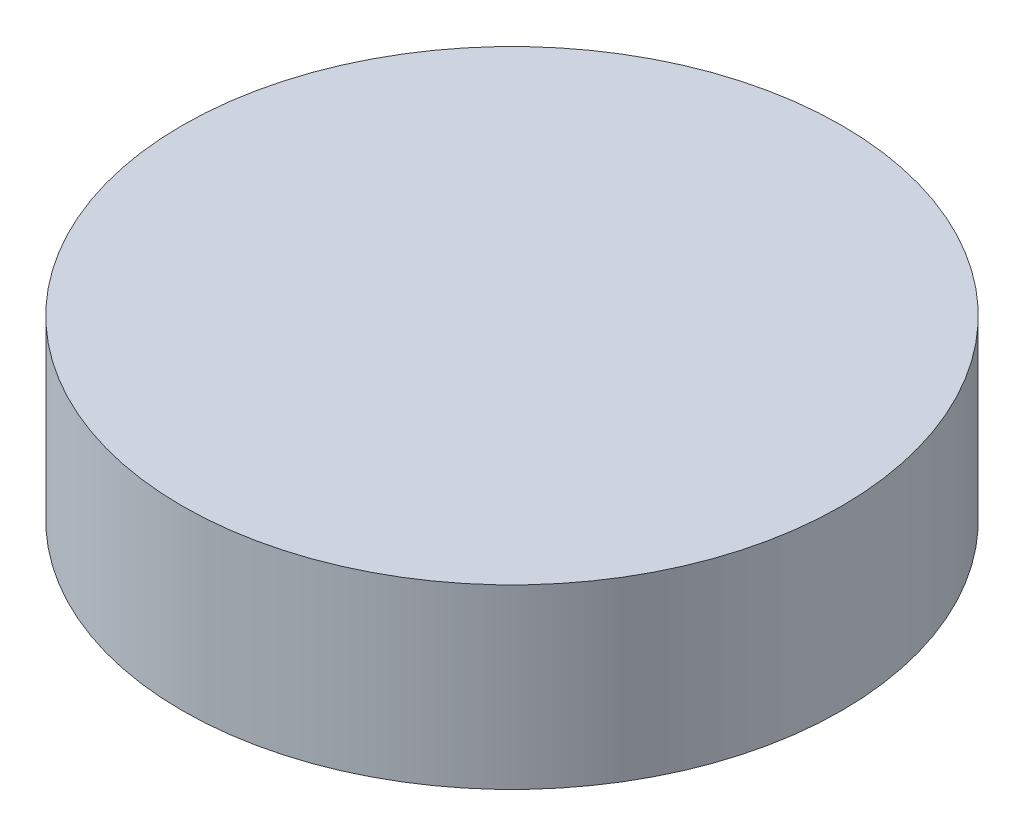
ISO-10303-21;
HEADER;
FILE_DESCRIPTION(('STEP AP214'),'2;1');
FILE_NAME('part.step','',(''),(''),'','','');
FILE_SCHEMA(('AUTOMOTIVE_DESIGN { 1 0 10303 214 1 1 1 1 }'));
ENDSEC;
DATA;
#1=APPLICATION_CONTEXT('core data for automotive mechanical design processes');
#2=APPLICATION_PROTOCOL_DEFINITION('international standard','automotive_design',2000,#1);
#3=PRODUCT_CONTEXT('',#1,'mechanical');
#4=PRODUCT('Part','Part','',(#3));
#5=PRODUCT_RELATED_PRODUCT_CATEGORY('part','',(#4));
#6=PRODUCT_DEFINITION_FORMATION('','',#4);
#7=PRODUCT_DEFINITION_CONTEXT('part definition',#1,'design');
#8=PRODUCT_DEFINITION('design','',#6,#7);
#9=PRODUCT_DEFINITION_SHAPE('','',#8);
#10=(LENGTH_UNIT() NAMED_UNIT(*) SI_UNIT(.MILLI.,.METRE.));
#11=(NAMED_UNIT(*) PLANE_ANGLE_UNIT() SI_UNIT($,.RADIAN.));
#12=(NAMED_UNIT(*) SI_UNIT($,.STERADIAN.) SOLID_ANGLE_UNIT());
#13=UNCERTAINTY_MEASURE_WITH_UNIT(LENGTH_MEASURE(1.E-05),#10,'distance_accuracy_value','');
#14=(GEOMETRIC_REPRESENTATION_CONTEXT(3) GLOBAL_UNCERTAINTY_ASSIGNED_CONTEXT((#13)) GLOBAL_UNIT_ASSIGNED_CONTEXT((#10,
#11,#12)) REPRESENTATION_CONTEXT('',''));
#15=CARTESIAN_POINT('',(0.,0.,0.));
#16=DIRECTION('',(0.,0.,1.));
#17=DIRECTION('',(1.,0.,0.));
#18=AXIS2_PLACEMENT_3D('',#15,#16,#17);
#19=CARTESIAN_POINT('',(0.,11.5,0.));
#20=DIRECTION('',(0.,-1.,0.));
#21=DIRECTION('',(0.,0.,-1.));
#22=AXIS2_PLACEMENT_3D('',#19,#20,#21);
#23=CYLINDRICAL_SURFACE('',#22,21.4);
#24=CARTESIAN_POINT('',(0.,11.5,0.));
#25=DIRECTION('',(0.,1.,0.));
#26=DIRECTION('',(0.,0.,1.));
#27=AXIS2_PLACEMENT_3D('',#24,#25,#26);
#28=CIRCLE('',#27,21.4);
#29=CARTESIAN_POINT('',(0.,11.5,21.4));
#30=VERTEX_POINT('',#29);
#31=EDGE_CURVE('E10',#30,#30,#28,.T.);
#32=ORIENTED_EDGE('',*,*,#31,.F.);
#33=EDGE_LOOP('',(#32));
#34=FACE_BOUND('',#33,.T.);
#35=CARTESIAN_POINT('',(0.,0.,0.));
#36=DIRECTION('',(0.,1.,0.));
#37=DIRECTION('',(0.,0.,1.));
#38=AXIS2_PLACEMENT_3D('',#35,#36,#37);
#39=CIRCLE('',#38,21.4);
#40=CARTESIAN_POINT('',(0.,0.,21.4));
#41=VERTEX_POINT('',#40);
#42=EDGE_CURVE('E40',#41,#41,#39,.T.);
#43=ORIENTED_EDGE('',*,*,#42,.T.);
#44=EDGE_LOOP('',(#43));
#45=FACE_BOUND('',#44,.T.);
#46=ADVANCED_FACE('F37',(#34,#45),#23,.T.);
#47=CARTESIAN_POINT('',(0.,11.5,0.));
#48=DIRECTION('',(0.,1.,0.));
#49=DIRECTION('',(0.,0.,1.));
#50=AXIS2_PLACEMENT_3D('',#47,#48,#49);
#51=PLANE('',#50);
#52=ORIENTED_EDGE('',*,*,#31,.T.);
#53=EDGE_LOOP('',(#52));
#54=FACE_BOUND('',#53,.T.);
#55=ADVANCED_FACE('F83',(#54),#51,.T.);
#56=CARTESIAN_POINT('',(0.,0.,0.));
#57=DIRECTION('',(0.,1.,0.));
#58=DIRECTION('',(0.,0.,1.));
#59=AXIS2_PLACEMENT_3D('',#56,#57,#58);
#60=PLANE('',#59);
#61=CARTESIAN_POINT('',(-8.6,0.,0.));
#62=DIRECTION('',(0.,1.,0.));
#63=DIRECTION('',(0.,0.,1.));
#64=AXIS2_PLACEMENT_3D('',#61,#62,#63);
#65=CIRCLE('',#64,1.55);
#66=CARTESIAN_POINT('',(-8.6,0.,1.55));
#67=VERTEX_POINT('',#66);
#68=EDGE_CURVE('E49',#67,#67,#65,.T.);
#69=ORIENTED_EDGE('',*,*,#68,.T.);
#70=EDGE_LOOP('',(#69));
#71=FACE_BOUND('',#70,.T.);
#72=CARTESIAN_POINT('',(8.6,0.,0.));
#73=DIRECTION('',(0.,1.,0.));
#74=DIRECTION('',(0.,0.,1.));
#75=AXIS2_PLACEMENT_3D('',#72,#73,#74);
#76=CIRCLE('',#75,1.55);
#77=CARTESIAN_POINT('',(8.6,0.,1.55));
#78=VERTEX_POINT('',#77);
#79=EDGE_CURVE('E58',#78,#78,#76,.T.);
#80=ORIENTED_EDGE('',*,*,#79,.T.);
#81=EDGE_LOOP('',(#80));
#82=FACE_BOUND('',#81,.T.);
#83=ORIENTED_EDGE('',*,*,#42,.F.);
#84=EDGE_LOOP('',(#83));
#85=FACE_BOUND('',#84,.T.);
#86=ADVANCED_FACE('F88',(#71,#82,#85),#60,.F.);
#87=CARTESIAN_POINT('',(0.,-5.,0.));
#88=DIRECTION('',(0.,1.,0.));
#89=DIRECTION('',(0.,0.,1.));
#90=AXIS2_PLACEMENT_3D('',#87,#88,#89);
#91=PLANE('',#90);
#92=CARTESIAN_POINT('',(-8.6,-5.,0.));
#93=DIRECTION('',(0.,1.,0.));
#94=DIRECTION('',(0.,0.,1.));
#95=AXIS2_PLACEMENT_3D('',#92,#93,#94);
#96=CIRCLE('',#95,1.55);
#97=CARTESIAN_POINT('',(-8.6,-5.,1.55));
#98=VERTEX_POINT('',#97);
#99=EDGE_CURVE('E54',#98,#98,#96,.T.);
#100=ORIENTED_EDGE('',*,*,#99,.F.);
#101=EDGE_LOOP('',(#100));
#102=FACE_BOUND('',#101,.T.);
#103=ADVANCED_FACE('F79',(#102),#91,.F.);
#104=CARTESIAN_POINT('',(-8.6,-5.,0.));
#105=DIRECTION('',(0.,1.,0.));
#106=DIRECTION('',(0.,0.,1.));
#107=AXIS2_PLACEMENT_3D('',#104,#105,#106);
#108=CYLINDRICAL_SURFACE('',#107,1.55);
#109=ORIENTED_EDGE('',*,*,#99,.T.);
#110=EDGE_LOOP('',(#109));
#111=FACE_BOUND('',#110,.T.);
#112=ORIENTED_EDGE('',*,*,#68,.F.);
#113=EDGE_LOOP('',(#112));
#114=FACE_BOUND('',#113,.T.);
#115=ADVANCED_FACE('F72',(#111,#114),#108,.T.);
#116=CARTESIAN_POINT('',(0.,-5.,0.));
#117=DIRECTION('',(0.,1.,0.));
#118=DIRECTION('',(0.,0.,1.));
#119=AXIS2_PLACEMENT_3D('',#116,#117,#118);
#120=PLANE('',#119);
#121=CARTESIAN_POINT('',(8.6,-5.,0.));
#122=DIRECTION('',(0.,1.,0.));
#123=DIRECTION('',(0.,0.,1.));
#124=AXIS2_PLACEMENT_3D('',#121,#122,#123);
#125=CIRCLE('',#124,1.55);
#126=CARTESIAN_POINT('',(8.6,-5.,1.55));
#127=VERTEX_POINT('',#126);
#128=EDGE_CURVE('E62',#127,#127,#125,.T.);
#129=ORIENTED_EDGE('',*,*,#128,.F.);
#130=EDGE_LOOP('',(#129));
#131=FACE_BOUND('',#130,.T.);
#132=ADVANCED_FACE('F70',(#131),#120,.F.);
#133=CARTESIAN_POINT('',(8.6,-5.,0.));
#134=DIRECTION('',(0.,1.,0.));
#135=DIRECTION('',(0.,0.,1.));
#136=AXIS2_PLACEMENT_3D('',#133,#134,#135);
#137=CYLINDRICAL_SURFACE('',#136,1.55);
#138=ORIENTED_EDGE('',*,*,#128,.T.);
#139=EDGE_LOOP('',(#138));
#140=FACE_BOUND('',#139,.T.);
#141=ORIENTED_EDGE('',*,*,#79,.F.);
#142=EDGE_LOOP('',(#141));
#143=FACE_BOUND('',#142,.T.);
#144=ADVANCED_FACE('F67',(#140,#143),#137,.T.);
#145=CLOSED_SHELL('',(#46,#55,#86,#103,#115,#132,#144));
#146=MANIFOLD_SOLID_BREP('B2',#145);
#147=ADVANCED_BREP_SHAPE_REPRESENTATION('',(#18,#146),#14);
#148=SHAPE_DEFINITION_REPRESENTATION(#9,#147);
ENDSEC;
END-ISO-10303-21;
